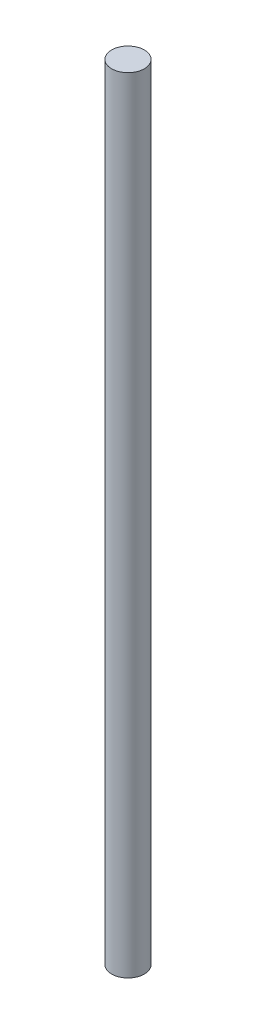
ISO-10303-21;
HEADER;
FILE_DESCRIPTION(('STEP AP214'),'2;1');
FILE_NAME('part.step','',(''),(''),'','','');
FILE_SCHEMA(('AUTOMOTIVE_DESIGN { 1 0 10303 214 1 1 1 1 }'));
ENDSEC;
DATA;
#1=APPLICATION_CONTEXT('core data for automotive mechanical design processes');
#2=APPLICATION_PROTOCOL_DEFINITION('international standard','automotive_design',2000,#1);
#3=PRODUCT_CONTEXT('',#1,'mechanical');
#4=PRODUCT('Part','Part','',(#3));
#5=PRODUCT_RELATED_PRODUCT_CATEGORY('part','',(#4));
#6=PRODUCT_DEFINITION_FORMATION('','',#4);
#7=PRODUCT_DEFINITION_CONTEXT('part definition',#1,'design');
#8=PRODUCT_DEFINITION('design','',#6,#7);
#9=PRODUCT_DEFINITION_SHAPE('','',#8);
#10=(LENGTH_UNIT() NAMED_UNIT(*) SI_UNIT(.MILLI.,.METRE.));
#11=(NAMED_UNIT(*) PLANE_ANGLE_UNIT() SI_UNIT($,.RADIAN.));
#12=(NAMED_UNIT(*) SI_UNIT($,.STERADIAN.) SOLID_ANGLE_UNIT());
#13=UNCERTAINTY_MEASURE_WITH_UNIT(LENGTH_MEASURE(1.E-05),#10,'distance_accuracy_value','');
#14=(GEOMETRIC_REPRESENTATION_CONTEXT(3) GLOBAL_UNCERTAINTY_ASSIGNED_CONTEXT((#13)) GLOBAL_UNIT_ASSIGNED_CONTEXT((#10,
#11,#12)) REPRESENTATION_CONTEXT('',''));
#15=CARTESIAN_POINT('',(0.,0.,0.));
#16=DIRECTION('',(0.,0.,1.));
#17=DIRECTION('',(1.,0.,0.));
#18=AXIS2_PLACEMENT_3D('',#15,#16,#17);
#19=CARTESIAN_POINT('',(0.,304.8,0.));
#20=DIRECTION('',(0.,-1.,0.));
#21=DIRECTION('',(0.,0.,-1.));
#22=AXIS2_PLACEMENT_3D('',#19,#20,#21);
#23=CYLINDRICAL_SURFACE('',#22,6.35);
#24=CARTESIAN_POINT('',(0.,304.8,0.));
#25=DIRECTION('',(0.,1.,0.));
#26=DIRECTION('',(0.,0.,1.));
#27=AXIS2_PLACEMENT_3D('',#24,#25,#26);
#28=CIRCLE('',#27,6.35);
#29=CARTESIAN_POINT('',(0.,304.8,6.35));
#30=VERTEX_POINT('',#29);
#31=EDGE_CURVE('E10',#30,#30,#28,.T.);
#32=ORIENTED_EDGE('',*,*,#31,.F.);
#33=EDGE_LOOP('',(#32));
#34=FACE_BOUND('',#33,.T.);
#35=CARTESIAN_POINT('',(0.,0.,0.));
#36=DIRECTION('',(0.,1.,0.));
#37=DIRECTION('',(0.,0.,1.));
#38=AXIS2_PLACEMENT_3D('',#35,#36,#37);
#39=CIRCLE('',#38,6.35);
#40=CARTESIAN_POINT('',(0.,0.,6.35));
#41=VERTEX_POINT('',#40);
#42=EDGE_CURVE('E36',#41,#41,#39,.T.);
#43=ORIENTED_EDGE('',*,*,#42,.T.);
#44=EDGE_LOOP('',(#43));
#45=FACE_BOUND('',#44,.T.);
#46=ADVANCED_FACE('F33',(#34,#45),#23,.T.);
#47=CARTESIAN_POINT('',(0.,304.8,0.));
#48=DIRECTION('',(0.,1.,0.));
#49=DIRECTION('',(0.,0.,1.));
#50=AXIS2_PLACEMENT_3D('',#47,#48,#49);
#51=PLANE('',#50);
#52=ORIENTED_EDGE('',*,*,#31,.T.);
#53=EDGE_LOOP('',(#52));
#54=FACE_BOUND('',#53,.T.);
#55=ADVANCED_FACE('F48',(#54),#51,.T.);
#56=CARTESIAN_POINT('',(0.,0.,0.));
#57=DIRECTION('',(0.,1.,0.));
#58=DIRECTION('',(0.,0.,1.));
#59=AXIS2_PLACEMENT_3D('',#56,#57,#58);
#60=PLANE('',#59);
#61=ORIENTED_EDGE('',*,*,#42,.F.);
#62=EDGE_LOOP('',(#61));
#63=FACE_BOUND('',#62,.T.);
#64=ADVANCED_FACE('F46',(#63),#60,.F.);
#65=CLOSED_SHELL('',(#46,#55,#64));
#66=MANIFOLD_SOLID_BREP('B2',#65);
#67=ADVANCED_BREP_SHAPE_REPRESENTATION('',(#18,#66),#14);
#68=SHAPE_DEFINITION_REPRESENTATION(#9,#67);
ENDSEC;
END-ISO-10303-21;
